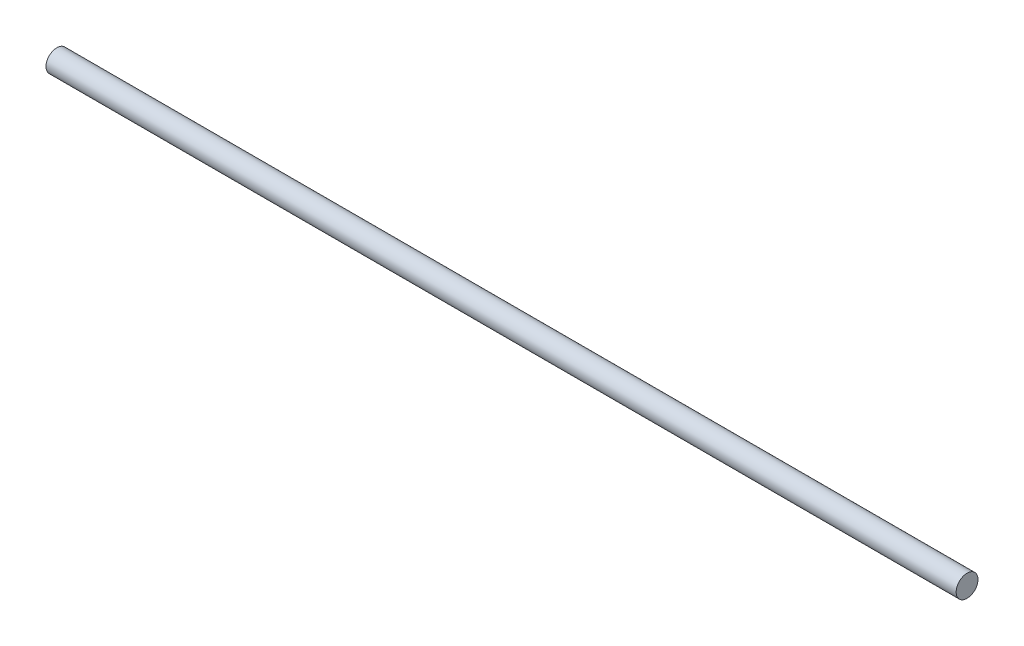
ISO-10303-21;
HEADER;
FILE_DESCRIPTION(('STEP AP214'),'2;1');
FILE_NAME('part.step','',(''),(''),'','','');
FILE_SCHEMA(('AUTOMOTIVE_DESIGN { 1 0 10303 214 1 1 1 1 }'));
ENDSEC;
DATA;
#1=APPLICATION_CONTEXT('core data for automotive mechanical design processes');
#2=APPLICATION_PROTOCOL_DEFINITION('international standard','automotive_design',2000,#1);
#3=PRODUCT_CONTEXT('',#1,'mechanical');
#4=PRODUCT('Part','Part','',(#3));
#5=PRODUCT_RELATED_PRODUCT_CATEGORY('part','',(#4));
#6=PRODUCT_DEFINITION_FORMATION('','',#4);
#7=PRODUCT_DEFINITION_CONTEXT('part definition',#1,'design');
#8=PRODUCT_DEFINITION('design','',#6,#7);
#9=PRODUCT_DEFINITION_SHAPE('','',#8);
#10=(LENGTH_UNIT() NAMED_UNIT(*) SI_UNIT(.MILLI.,.METRE.));
#11=(NAMED_UNIT(*) PLANE_ANGLE_UNIT() SI_UNIT($,.RADIAN.));
#12=(NAMED_UNIT(*) SI_UNIT($,.STERADIAN.) SOLID_ANGLE_UNIT());
#13=UNCERTAINTY_MEASURE_WITH_UNIT(LENGTH_MEASURE(1.E-05),#10,'distance_accuracy_value','');
#14=(GEOMETRIC_REPRESENTATION_CONTEXT(3) GLOBAL_UNCERTAINTY_ASSIGNED_CONTEXT((#13)) GLOBAL_UNIT_ASSIGNED_CONTEXT((#10,
#11,#12)) REPRESENTATION_CONTEXT('',''));
#15=CARTESIAN_POINT('',(0.,0.,0.));
#16=DIRECTION('',(0.,0.,1.));
#17=DIRECTION('',(1.,0.,0.));
#18=AXIS2_PLACEMENT_3D('',#15,#16,#17);
#19=CARTESIAN_POINT('',(250.,0.,0.));
#20=DIRECTION('',(-1.,0.,0.));
#21=DIRECTION('',(0.,0.,1.));
#22=AXIS2_PLACEMENT_3D('',#19,#20,#21);
#23=CYLINDRICAL_SURFACE('',#22,3.);
#24=CARTESIAN_POINT('',(250.,0.,0.));
#25=DIRECTION('',(1.,0.,0.));
#26=DIRECTION('',(0.,0.,-1.));
#27=AXIS2_PLACEMENT_3D('',#24,#25,#26);
#28=CIRCLE('',#27,3.);
#29=CARTESIAN_POINT('',(250.,0.,-3.));
#30=VERTEX_POINT('',#29);
#31=EDGE_CURVE('E10',#30,#30,#28,.T.);
#32=ORIENTED_EDGE('',*,*,#31,.F.);
#33=EDGE_LOOP('',(#32));
#34=FACE_BOUND('',#33,.T.);
#35=CARTESIAN_POINT('',(0.,0.,0.));
#36=DIRECTION('',(1.,0.,0.));
#37=DIRECTION('',(0.,0.,-1.));
#38=AXIS2_PLACEMENT_3D('',#35,#36,#37);
#39=CIRCLE('',#38,3.);
#40=CARTESIAN_POINT('',(0.,0.,-3.));
#41=VERTEX_POINT('',#40);
#42=EDGE_CURVE('E34',#41,#41,#39,.T.);
#43=ORIENTED_EDGE('',*,*,#42,.T.);
#44=EDGE_LOOP('',(#43));
#45=FACE_BOUND('',#44,.T.);
#46=ADVANCED_FACE('F31',(#34,#45),#23,.T.);
#47=CARTESIAN_POINT('',(250.,0.,0.));
#48=DIRECTION('',(1.,0.,0.));
#49=DIRECTION('',(0.,0.,-1.));
#50=AXIS2_PLACEMENT_3D('',#47,#48,#49);
#51=PLANE('',#50);
#52=ORIENTED_EDGE('',*,*,#31,.T.);
#53=EDGE_LOOP('',(#52));
#54=FACE_BOUND('',#53,.T.);
#55=ADVANCED_FACE('F46',(#54),#51,.T.);
#56=CARTESIAN_POINT('',(0.,0.,0.));
#57=DIRECTION('',(1.,0.,0.));
#58=DIRECTION('',(0.,0.,-1.));
#59=AXIS2_PLACEMENT_3D('',#56,#57,#58);
#60=PLANE('',#59);
#61=ORIENTED_EDGE('',*,*,#42,.F.);
#62=EDGE_LOOP('',(#61));
#63=FACE_BOUND('',#62,.T.);
#64=ADVANCED_FACE('F44',(#63),#60,.F.);
#65=CLOSED_SHELL('',(#46,#55,#64));
#66=MANIFOLD_SOLID_BREP('B2',#65);
#67=ADVANCED_BREP_SHAPE_REPRESENTATION('',(#18,#66),#14);
#68=SHAPE_DEFINITION_REPRESENTATION(#9,#67);
ENDSEC;
END-ISO-10303-21;
